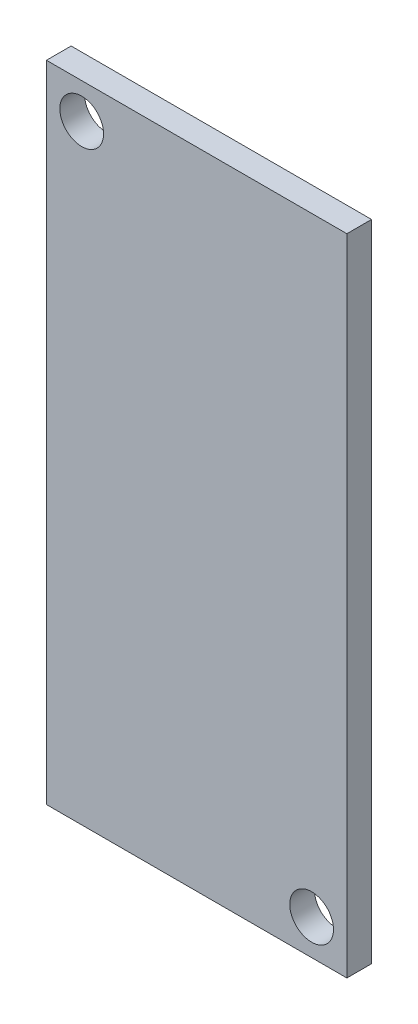
ISO-10303-21;
HEADER;
FILE_DESCRIPTION(('STEP AP214'),'2;1');
FILE_NAME('part.step','',(''),(''),'','','');
FILE_SCHEMA(('AUTOMOTIVE_DESIGN { 1 0 10303 214 1 1 1 1 }'));
ENDSEC;
DATA;
#1=APPLICATION_CONTEXT('core data for automotive mechanical design processes');
#2=APPLICATION_PROTOCOL_DEFINITION('international standard','automotive_design',2000,#1);
#3=PRODUCT_CONTEXT('',#1,'mechanical');
#4=PRODUCT('Part','Part','',(#3));
#5=PRODUCT_RELATED_PRODUCT_CATEGORY('part','',(#4));
#6=PRODUCT_DEFINITION_FORMATION('','',#4);
#7=PRODUCT_DEFINITION_CONTEXT('part definition',#1,'design');
#8=PRODUCT_DEFINITION('design','',#6,#7);
#9=PRODUCT_DEFINITION_SHAPE('','',#8);
#10=(LENGTH_UNIT() NAMED_UNIT(*) SI_UNIT(.MILLI.,.METRE.));
#11=(NAMED_UNIT(*) PLANE_ANGLE_UNIT() SI_UNIT($,.RADIAN.));
#12=(NAMED_UNIT(*) SI_UNIT($,.STERADIAN.) SOLID_ANGLE_UNIT());
#13=UNCERTAINTY_MEASURE_WITH_UNIT(LENGTH_MEASURE(1.E-05),#10,'distance_accuracy_value','');
#14=(GEOMETRIC_REPRESENTATION_CONTEXT(3) GLOBAL_UNCERTAINTY_ASSIGNED_CONTEXT((#13)) GLOBAL_UNIT_ASSIGNED_CONTEXT((#10,
#11,#12)) REPRESENTATION_CONTEXT('',''));
#15=CARTESIAN_POINT('',(0.,0.,0.));
#16=DIRECTION('',(0.,0.,1.));
#17=DIRECTION('',(1.,0.,0.));
#18=AXIS2_PLACEMENT_3D('',#15,#16,#17);
#19=CARTESIAN_POINT('',(-10.65,22.85,1.75));
#20=DIRECTION('',(1.,0.,0.));
#21=DIRECTION('',(0.,0.,-1.));
#22=AXIS2_PLACEMENT_3D('',#19,#20,#21);
#23=PLANE('',#22);
#24=DIRECTION('',(0.,-1.,0.));
#25=VECTOR('',#24,1.);
#26=CARTESIAN_POINT('',(-10.65,22.85,0.));
#27=LINE('',#26,#25);
#28=CARTESIAN_POINT('',(-10.65,22.85,0.));
#29=VERTEX_POINT('',#28);
#30=CARTESIAN_POINT('',(-10.65,-22.85,0.));
#31=VERTEX_POINT('',#30);
#32=EDGE_CURVE('E99',#29,#31,#27,.T.);
#33=ORIENTED_EDGE('',*,*,#32,.T.);
#34=DIRECTION('',(0.,0.,-1.));
#35=VECTOR('',#34,1.);
#36=CARTESIAN_POINT('',(-10.65,-22.85,1.75));
#37=LINE('',#36,#35);
#38=CARTESIAN_POINT('',(-10.65,-22.85,1.75));
#39=VERTEX_POINT('',#38);
#40=EDGE_CURVE('E11',#39,#31,#37,.T.);
#41=ORIENTED_EDGE('',*,*,#40,.F.);
#42=DIRECTION('',(0.,-1.,0.));
#43=VECTOR('',#42,1.);
#44=CARTESIAN_POINT('',(-10.65,22.85,1.75));
#45=LINE('',#44,#43);
#46=CARTESIAN_POINT('',(-10.65,22.85,1.75));
#47=VERTEX_POINT('',#46);
#48=EDGE_CURVE('E87',#47,#39,#45,.T.);
#49=ORIENTED_EDGE('',*,*,#48,.F.);
#50=DIRECTION('',(0.,0.,-1.));
#51=VECTOR('',#50,1.);
#52=CARTESIAN_POINT('',(-10.65,22.85,1.75));
#53=LINE('',#52,#51);
#54=EDGE_CURVE('E95',#47,#29,#53,.T.);
#55=ORIENTED_EDGE('',*,*,#54,.T.);
#56=EDGE_LOOP('',(#33,#41,#49,#55));
#57=FACE_BOUND('',#56,.T.);
#58=ADVANCED_FACE('F36',(#57),#23,.F.);
#59=CARTESIAN_POINT('',(-10.65,-22.85,1.75));
#60=DIRECTION('',(0.,1.,0.));
#61=DIRECTION('',(0.,0.,1.));
#62=AXIS2_PLACEMENT_3D('',#59,#60,#61);
#63=PLANE('',#62);
#64=DIRECTION('',(1.,0.,0.));
#65=VECTOR('',#64,1.);
#66=CARTESIAN_POINT('',(-10.65,-22.85,0.));
#67=LINE('',#66,#65);
#68=CARTESIAN_POINT('',(10.65,-22.85,0.));
#69=VERTEX_POINT('',#68);
#70=EDGE_CURVE('E91',#31,#69,#67,.T.);
#71=ORIENTED_EDGE('',*,*,#70,.T.);
#72=DIRECTION('',(0.,0.,-1.));
#73=VECTOR('',#72,1.);
#74=CARTESIAN_POINT('',(10.65,-22.85,1.75));
#75=LINE('',#74,#73);
#76=CARTESIAN_POINT('',(10.65,-22.85,1.75));
#77=VERTEX_POINT('',#76);
#78=EDGE_CURVE('E44',#77,#69,#75,.T.);
#79=ORIENTED_EDGE('',*,*,#78,.F.);
#80=DIRECTION('',(1.,0.,0.));
#81=VECTOR('',#80,1.);
#82=CARTESIAN_POINT('',(-10.65,-22.85,1.75));
#83=LINE('',#82,#81);
#84=EDGE_CURVE('E82',#39,#77,#83,.T.);
#85=ORIENTED_EDGE('',*,*,#84,.F.);
#86=ORIENTED_EDGE('',*,*,#40,.T.);
#87=EDGE_LOOP('',(#71,#79,#85,#86));
#88=FACE_BOUND('',#87,.T.);
#89=ADVANCED_FACE('F90',(#88),#63,.F.);
#90=CARTESIAN_POINT('',(10.65,22.85,1.75));
#91=DIRECTION('',(-1.,0.,0.));
#92=DIRECTION('',(0.,0.,1.));
#93=AXIS2_PLACEMENT_3D('',#90,#91,#92);
#94=PLANE('',#93);
#95=DIRECTION('',(0.,1.,0.));
#96=VECTOR('',#95,1.);
#97=CARTESIAN_POINT('',(10.65,22.85,0.));
#98=LINE('',#97,#96);
#99=CARTESIAN_POINT('',(10.65,22.85,0.));
#100=VERTEX_POINT('',#99);
#101=EDGE_CURVE('E69',#69,#100,#98,.T.);
#102=ORIENTED_EDGE('',*,*,#101,.T.);
#103=DIRECTION('',(0.,0.,-1.));
#104=VECTOR('',#103,1.);
#105=CARTESIAN_POINT('',(10.65,22.85,1.75));
#106=LINE('',#105,#104);
#107=CARTESIAN_POINT('',(10.65,22.85,1.75));
#108=VERTEX_POINT('',#107);
#109=EDGE_CURVE('E92',#108,#100,#106,.T.);
#110=ORIENTED_EDGE('',*,*,#109,.F.);
#111=DIRECTION('',(0.,1.,0.));
#112=VECTOR('',#111,1.);
#113=CARTESIAN_POINT('',(10.65,22.85,1.75));
#114=LINE('',#113,#112);
#115=EDGE_CURVE('E85',#77,#108,#114,.T.);
#116=ORIENTED_EDGE('',*,*,#115,.F.);
#117=ORIENTED_EDGE('',*,*,#78,.T.);
#118=EDGE_LOOP('',(#102,#110,#116,#117));
#119=FACE_BOUND('',#118,.T.);
#120=ADVANCED_FACE('F93',(#119),#94,.F.);
#121=CARTESIAN_POINT('',(-10.65,22.85,1.75));
#122=DIRECTION('',(0.,-1.,0.));
#123=DIRECTION('',(0.,0.,-1.));
#124=AXIS2_PLACEMENT_3D('',#121,#122,#123);
#125=PLANE('',#124);
#126=DIRECTION('',(-1.,0.,0.));
#127=VECTOR('',#126,1.);
#128=CARTESIAN_POINT('',(-10.65,22.85,0.));
#129=LINE('',#128,#127);
#130=EDGE_CURVE('E75',#100,#29,#129,.T.);
#131=ORIENTED_EDGE('',*,*,#130,.T.);
#132=ORIENTED_EDGE('',*,*,#54,.F.);
#133=DIRECTION('',(-1.,0.,0.));
#134=VECTOR('',#133,1.);
#135=CARTESIAN_POINT('',(-10.65,22.85,1.75));
#136=LINE('',#135,#134);
#137=EDGE_CURVE('E52',#108,#47,#136,.T.);
#138=ORIENTED_EDGE('',*,*,#137,.F.);
#139=ORIENTED_EDGE('',*,*,#109,.T.);
#140=EDGE_LOOP('',(#131,#132,#138,#139));
#141=FACE_BOUND('',#140,.T.);
#142=ADVANCED_FACE('F107',(#141),#125,.F.);
#143=CARTESIAN_POINT('',(-10.65,-22.85,1.75));
#144=DIRECTION('',(0.,0.,1.));
#145=DIRECTION('',(1.,0.,0.));
#146=AXIS2_PLACEMENT_3D('',#143,#144,#145);
#147=PLANE('',#146);
#148=CARTESIAN_POINT('',(-8.15,20.35,1.75));
#149=DIRECTION('',(0.,0.,1.));
#150=DIRECTION('',(1.,0.,0.));
#151=AXIS2_PLACEMENT_3D('',#148,#149,#150);
#152=CIRCLE('',#151,1.55);
#153=CARTESIAN_POINT('',(-6.6,20.35,1.75));
#154=VERTEX_POINT('',#153);
#155=EDGE_CURVE('E121',#154,#154,#152,.T.);
#156=ORIENTED_EDGE('',*,*,#155,.F.);
#157=EDGE_LOOP('',(#156));
#158=FACE_BOUND('',#157,.T.);
#159=CARTESIAN_POINT('',(8.15,-20.35,1.75));
#160=DIRECTION('',(0.,0.,1.));
#161=DIRECTION('',(1.,0.,0.));
#162=AXIS2_PLACEMENT_3D('',#159,#160,#161);
#163=CIRCLE('',#162,1.55);
#164=CARTESIAN_POINT('',(9.7,-20.35,1.75));
#165=VERTEX_POINT('',#164);
#166=EDGE_CURVE('E115',#165,#165,#163,.T.);
#167=ORIENTED_EDGE('',*,*,#166,.F.);
#168=EDGE_LOOP('',(#167));
#169=FACE_BOUND('',#168,.T.);
#170=ORIENTED_EDGE('',*,*,#48,.T.);
#171=ORIENTED_EDGE('',*,*,#84,.T.);
#172=ORIENTED_EDGE('',*,*,#115,.T.);
#173=ORIENTED_EDGE('',*,*,#137,.T.);
#174=EDGE_LOOP('',(#170,#171,#172,#173));
#175=FACE_BOUND('',#174,.T.);
#176=ADVANCED_FACE('F83',(#158,#169,#175),#147,.T.);
#177=CARTESIAN_POINT('',(-10.65,-22.85,0.));
#178=DIRECTION('',(0.,0.,1.));
#179=DIRECTION('',(1.,0.,0.));
#180=AXIS2_PLACEMENT_3D('',#177,#178,#179);
#181=PLANE('',#180);
#182=CARTESIAN_POINT('',(-8.15,20.35,0.));
#183=DIRECTION('',(0.,0.,1.));
#184=DIRECTION('',(1.,0.,0.));
#185=AXIS2_PLACEMENT_3D('',#182,#183,#184);
#186=CIRCLE('',#185,1.55);
#187=CARTESIAN_POINT('',(-6.6,20.35,0.));
#188=VERTEX_POINT('',#187);
#189=EDGE_CURVE('E118',#188,#188,#186,.F.);
#190=ORIENTED_EDGE('',*,*,#189,.F.);
#191=EDGE_LOOP('',(#190));
#192=FACE_BOUND('',#191,.T.);
#193=CARTESIAN_POINT('',(8.15,-20.35,0.));
#194=DIRECTION('',(0.,0.,1.));
#195=DIRECTION('',(1.,0.,0.));
#196=AXIS2_PLACEMENT_3D('',#193,#194,#195);
#197=CIRCLE('',#196,1.55);
#198=CARTESIAN_POINT('',(9.7,-20.35,0.));
#199=VERTEX_POINT('',#198);
#200=EDGE_CURVE('E102',#199,#199,#197,.F.);
#201=ORIENTED_EDGE('',*,*,#200,.F.);
#202=EDGE_LOOP('',(#201));
#203=FACE_BOUND('',#202,.T.);
#204=ORIENTED_EDGE('',*,*,#32,.F.);
#205=ORIENTED_EDGE('',*,*,#130,.F.);
#206=ORIENTED_EDGE('',*,*,#101,.F.);
#207=ORIENTED_EDGE('',*,*,#70,.F.);
#208=EDGE_LOOP('',(#204,#205,#206,#207));
#209=FACE_BOUND('',#208,.T.);
#210=ADVANCED_FACE('F110',(#192,#203,#209),#181,.F.);
#211=CARTESIAN_POINT('',(8.15,-20.35,-4.3840620433566));
#212=DIRECTION('',(0.,0.,1.));
#213=DIRECTION('',(1.,0.,0.));
#214=AXIS2_PLACEMENT_3D('',#211,#212,#213);
#215=CYLINDRICAL_SURFACE('',#214,1.55);
#216=ORIENTED_EDGE('',*,*,#200,.T.);
#217=EDGE_LOOP('',(#216));
#218=FACE_BOUND('',#217,.T.);
#219=ORIENTED_EDGE('',*,*,#166,.T.);
#220=EDGE_LOOP('',(#219));
#221=FACE_BOUND('',#220,.T.);
#222=ADVANCED_FACE('F132',(#218,#221),#215,.F.);
#223=CARTESIAN_POINT('',(-8.15,20.35,-4.3840620433566));
#224=DIRECTION('',(0.,0.,1.));
#225=DIRECTION('',(1.,0.,0.));
#226=AXIS2_PLACEMENT_3D('',#223,#224,#225);
#227=CYLINDRICAL_SURFACE('',#226,1.55);
#228=ORIENTED_EDGE('',*,*,#189,.T.);
#229=EDGE_LOOP('',(#228));
#230=FACE_BOUND('',#229,.T.);
#231=ORIENTED_EDGE('',*,*,#155,.T.);
#232=EDGE_LOOP('',(#231));
#233=FACE_BOUND('',#232,.T.);
#234=ADVANCED_FACE('F125',(#230,#233),#227,.F.);
#235=CLOSED_SHELL('',(#58,#89,#120,#142,#176,#210,#222,#234));
#236=MANIFOLD_SOLID_BREP('B2',#235);
#237=ADVANCED_BREP_SHAPE_REPRESENTATION('',(#18,#236),#14);
#238=SHAPE_DEFINITION_REPRESENTATION(#9,#237);
ENDSEC;
END-ISO-10303-21;
